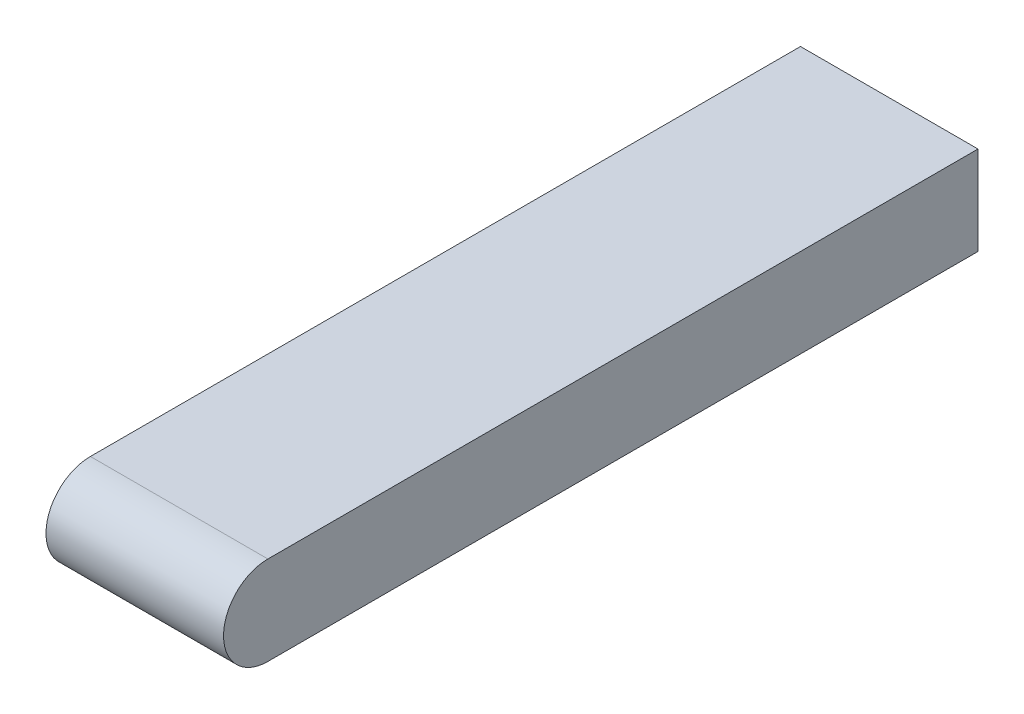
ISO-10303-21;
HEADER;
FILE_DESCRIPTION(('STEP AP214'),'2;1');
FILE_NAME('part.step','',(''),(''),'','','');
FILE_SCHEMA(('AUTOMOTIVE_DESIGN { 1 0 10303 214 1 1 1 1 }'));
ENDSEC;
DATA;
#1=APPLICATION_CONTEXT('core data for automotive mechanical design processes');
#2=APPLICATION_PROTOCOL_DEFINITION('international standard','automotive_design',2000,#1);
#3=PRODUCT_CONTEXT('',#1,'mechanical');
#4=PRODUCT('Part','Part','',(#3));
#5=PRODUCT_RELATED_PRODUCT_CATEGORY('part','',(#4));
#6=PRODUCT_DEFINITION_FORMATION('','',#4);
#7=PRODUCT_DEFINITION_CONTEXT('part definition',#1,'design');
#8=PRODUCT_DEFINITION('design','',#6,#7);
#9=PRODUCT_DEFINITION_SHAPE('','',#8);
#10=(LENGTH_UNIT() NAMED_UNIT(*) SI_UNIT(.MILLI.,.METRE.));
#11=(NAMED_UNIT(*) PLANE_ANGLE_UNIT() SI_UNIT($,.RADIAN.));
#12=(NAMED_UNIT(*) SI_UNIT($,.STERADIAN.) SOLID_ANGLE_UNIT());
#13=UNCERTAINTY_MEASURE_WITH_UNIT(LENGTH_MEASURE(1.E-05),#10,'distance_accuracy_value','');
#14=(GEOMETRIC_REPRESENTATION_CONTEXT(3) GLOBAL_UNCERTAINTY_ASSIGNED_CONTEXT((#13)) GLOBAL_UNIT_ASSIGNED_CONTEXT((#10,
#11,#12)) REPRESENTATION_CONTEXT('',''));
#15=CARTESIAN_POINT('',(0.,0.,0.));
#16=DIRECTION('',(0.,0.,1.));
#17=DIRECTION('',(1.,0.,0.));
#18=AXIS2_PLACEMENT_3D('',#15,#16,#17);
#19=CARTESIAN_POINT('',(25.4,-6.35,0.));
#20=DIRECTION('',(0.,1.,0.));
#21=DIRECTION('',(0.,0.,1.));
#22=AXIS2_PLACEMENT_3D('',#19,#20,#21);
#23=PLANE('',#22);
#24=DIRECTION('',(0.,0.,-1.));
#25=VECTOR('',#24,1.);
#26=CARTESIAN_POINT('',(0.,-6.35,0.));
#27=LINE('',#26,#25);
#28=CARTESIAN_POINT('',(0.,-6.35,12.7));
#29=VERTEX_POINT('',#28);
#30=CARTESIAN_POINT('',(0.,-6.35,-88.9));
#31=VERTEX_POINT('',#30);
#32=EDGE_CURVE('E79',#29,#31,#27,.T.);
#33=ORIENTED_EDGE('',*,*,#32,.T.);
#34=DIRECTION('',(-1.,0.,0.));
#35=VECTOR('',#34,1.);
#36=CARTESIAN_POINT('',(25.4,-6.35,-88.9));
#37=LINE('',#36,#35);
#38=CARTESIAN_POINT('',(25.4,-6.35,-88.9));
#39=VERTEX_POINT('',#38);
#40=EDGE_CURVE('E11',#39,#31,#37,.T.);
#41=ORIENTED_EDGE('',*,*,#40,.F.);
#42=DIRECTION('',(0.,0.,-1.));
#43=VECTOR('',#42,1.);
#44=CARTESIAN_POINT('',(25.4,-6.35,0.));
#45=LINE('',#44,#43);
#46=CARTESIAN_POINT('',(25.4,-6.35,12.7));
#47=VERTEX_POINT('',#46);
#48=EDGE_CURVE('E84',#47,#39,#45,.T.);
#49=ORIENTED_EDGE('',*,*,#48,.F.);
#50=DIRECTION('',(-1.,0.,0.));
#51=VECTOR('',#50,1.);
#52=CARTESIAN_POINT('',(25.4,-6.35,12.7));
#53=LINE('',#52,#51);
#54=EDGE_CURVE('E104',#47,#29,#53,.T.);
#55=ORIENTED_EDGE('',*,*,#54,.T.);
#56=EDGE_LOOP('',(#33,#41,#49,#55));
#57=FACE_BOUND('',#56,.T.);
#58=ADVANCED_FACE('F39',(#57),#23,.F.);
#59=CARTESIAN_POINT('',(25.4,6.35,-88.9));
#60=DIRECTION('',(0.,0.,1.));
#61=DIRECTION('',(1.,0.,0.));
#62=AXIS2_PLACEMENT_3D('',#59,#60,#61);
#63=PLANE('',#62);
#64=DIRECTION('',(0.,1.,0.));
#65=VECTOR('',#64,1.);
#66=CARTESIAN_POINT('',(0.,6.35,-88.9));
#67=LINE('',#66,#65);
#68=CARTESIAN_POINT('',(0.,6.35,-88.9));
#69=VERTEX_POINT('',#68);
#70=EDGE_CURVE('E97',#31,#69,#67,.T.);
#71=ORIENTED_EDGE('',*,*,#70,.T.);
#72=DIRECTION('',(-1.,0.,0.));
#73=VECTOR('',#72,1.);
#74=CARTESIAN_POINT('',(25.4,6.35,-88.9));
#75=LINE('',#74,#73);
#76=CARTESIAN_POINT('',(25.4,6.35,-88.9));
#77=VERTEX_POINT('',#76);
#78=EDGE_CURVE('E48',#77,#69,#75,.T.);
#79=ORIENTED_EDGE('',*,*,#78,.F.);
#80=DIRECTION('',(0.,1.,0.));
#81=VECTOR('',#80,1.);
#82=CARTESIAN_POINT('',(25.4,6.35,-88.9));
#83=LINE('',#82,#81);
#84=EDGE_CURVE('E87',#39,#77,#83,.T.);
#85=ORIENTED_EDGE('',*,*,#84,.F.);
#86=ORIENTED_EDGE('',*,*,#40,.T.);
#87=EDGE_LOOP('',(#71,#79,#85,#86));
#88=FACE_BOUND('',#87,.T.);
#89=ADVANCED_FACE('F96',(#88),#63,.F.);
#90=CARTESIAN_POINT('',(25.4,6.35,0.));
#91=DIRECTION('',(0.,-1.,0.));
#92=DIRECTION('',(0.,0.,-1.));
#93=AXIS2_PLACEMENT_3D('',#90,#91,#92);
#94=PLANE('',#93);
#95=DIRECTION('',(0.,0.,1.));
#96=VECTOR('',#95,1.);
#97=CARTESIAN_POINT('',(0.,6.35,0.));
#98=LINE('',#97,#96);
#99=CARTESIAN_POINT('',(0.,6.35,12.7));
#100=VERTEX_POINT('',#99);
#101=EDGE_CURVE('E72',#69,#100,#98,.T.);
#102=ORIENTED_EDGE('',*,*,#101,.T.);
#103=DIRECTION('',(-1.,0.,0.));
#104=VECTOR('',#103,1.);
#105=CARTESIAN_POINT('',(25.4,6.35,12.7));
#106=LINE('',#105,#104);
#107=CARTESIAN_POINT('',(25.4,6.35,12.7));
#108=VERTEX_POINT('',#107);
#109=EDGE_CURVE('E99',#108,#100,#106,.T.);
#110=ORIENTED_EDGE('',*,*,#109,.F.);
#111=DIRECTION('',(0.,0.,1.));
#112=VECTOR('',#111,1.);
#113=CARTESIAN_POINT('',(25.4,6.35,0.));
#114=LINE('',#113,#112);
#115=EDGE_CURVE('E91',#77,#108,#114,.T.);
#116=ORIENTED_EDGE('',*,*,#115,.F.);
#117=ORIENTED_EDGE('',*,*,#78,.T.);
#118=EDGE_LOOP('',(#102,#110,#116,#117));
#119=FACE_BOUND('',#118,.T.);
#120=ADVANCED_FACE('F100',(#119),#94,.F.);
#121=CARTESIAN_POINT('',(25.4,0.,12.7));
#122=DIRECTION('',(-1.,0.,0.));
#123=DIRECTION('',(0.,0.,1.));
#124=AXIS2_PLACEMENT_3D('',#121,#122,#123);
#125=CYLINDRICAL_SURFACE('',#124,6.35);
#126=CARTESIAN_POINT('',(0.,0.,12.7));
#127=DIRECTION('',(1.,0.,0.));
#128=DIRECTION('',(0.,0.,-1.));
#129=AXIS2_PLACEMENT_3D('',#126,#127,#128);
#130=CIRCLE('',#129,6.35);
#131=EDGE_CURVE('E114',#100,#29,#130,.T.);
#132=ORIENTED_EDGE('',*,*,#131,.T.);
#133=ORIENTED_EDGE('',*,*,#54,.F.);
#134=CARTESIAN_POINT('',(25.4,0.,12.7));
#135=DIRECTION('',(1.,0.,0.));
#136=DIRECTION('',(0.,0.,-1.));
#137=AXIS2_PLACEMENT_3D('',#134,#135,#136);
#138=CIRCLE('',#137,6.35);
#139=EDGE_CURVE('E56',#108,#47,#138,.T.);
#140=ORIENTED_EDGE('',*,*,#139,.F.);
#141=ORIENTED_EDGE('',*,*,#109,.T.);
#142=EDGE_LOOP('',(#132,#133,#140,#141));
#143=FACE_BOUND('',#142,.T.);
#144=ADVANCED_FACE('F122',(#143),#125,.T.);
#145=CARTESIAN_POINT('',(25.4,0.,12.7));
#146=DIRECTION('',(1.,0.,0.));
#147=DIRECTION('',(0.,0.,-1.));
#148=AXIS2_PLACEMENT_3D('',#145,#146,#147);
#149=PLANE('',#148);
#150=ORIENTED_EDGE('',*,*,#48,.T.);
#151=ORIENTED_EDGE('',*,*,#84,.T.);
#152=ORIENTED_EDGE('',*,*,#115,.T.);
#153=ORIENTED_EDGE('',*,*,#139,.T.);
#154=EDGE_LOOP('',(#150,#151,#152,#153));
#155=FACE_BOUND('',#154,.T.);
#156=ADVANCED_FACE('F89',(#155),#149,.T.);
#157=CARTESIAN_POINT('',(0.,0.,12.7));
#158=DIRECTION('',(1.,0.,0.));
#159=DIRECTION('',(0.,0.,-1.));
#160=AXIS2_PLACEMENT_3D('',#157,#158,#159);
#161=PLANE('',#160);
#162=ORIENTED_EDGE('',*,*,#32,.F.);
#163=ORIENTED_EDGE('',*,*,#131,.F.);
#164=ORIENTED_EDGE('',*,*,#101,.F.);
#165=ORIENTED_EDGE('',*,*,#70,.F.);
#166=EDGE_LOOP('',(#162,#163,#164,#165));
#167=FACE_BOUND('',#166,.T.);
#168=ADVANCED_FACE('F123',(#167),#161,.F.);
#169=CLOSED_SHELL('',(#58,#89,#120,#144,#156,#168));
#170=MANIFOLD_SOLID_BREP('B2',#169);
#171=ADVANCED_BREP_SHAPE_REPRESENTATION('',(#18,#170),#14);
#172=SHAPE_DEFINITION_REPRESENTATION(#9,#171);
ENDSEC;
END-ISO-10303-21;
